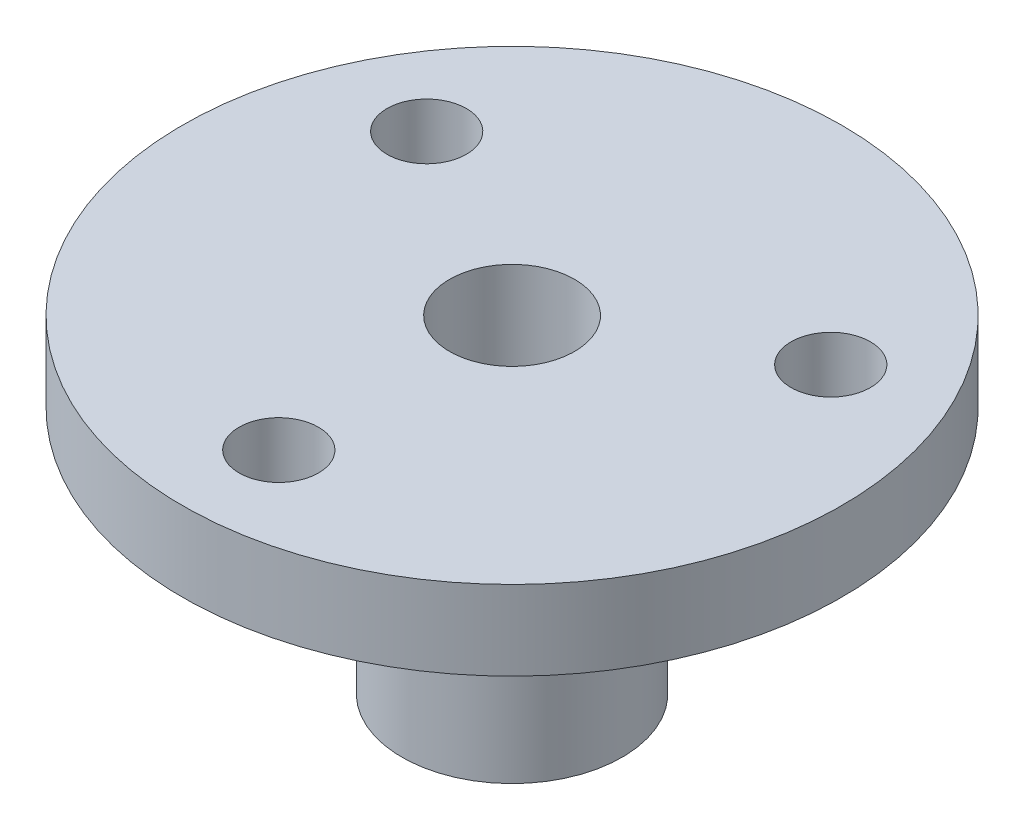
ISO-10303-21;
HEADER;
FILE_DESCRIPTION(('STEP AP214'),'2;1');
FILE_NAME('part.step','',(''),(''),'','','');
FILE_SCHEMA(('AUTOMOTIVE_DESIGN { 1 0 10303 214 1 1 1 1 }'));
ENDSEC;
DATA;
#1=APPLICATION_CONTEXT('core data for automotive mechanical design processes');
#2=APPLICATION_PROTOCOL_DEFINITION('international standard','automotive_design',2000,#1);
#3=PRODUCT_CONTEXT('',#1,'mechanical');
#4=PRODUCT('Part','Part','',(#3));
#5=PRODUCT_RELATED_PRODUCT_CATEGORY('part','',(#4));
#6=PRODUCT_DEFINITION_FORMATION('','',#4);
#7=PRODUCT_DEFINITION_CONTEXT('part definition',#1,'design');
#8=PRODUCT_DEFINITION('design','',#6,#7);
#9=PRODUCT_DEFINITION_SHAPE('','',#8);
#10=(LENGTH_UNIT() NAMED_UNIT(*) SI_UNIT(.MILLI.,.METRE.));
#11=(NAMED_UNIT(*) PLANE_ANGLE_UNIT() SI_UNIT($,.RADIAN.));
#12=(NAMED_UNIT(*) SI_UNIT($,.STERADIAN.) SOLID_ANGLE_UNIT());
#13=UNCERTAINTY_MEASURE_WITH_UNIT(LENGTH_MEASURE(1.E-05),#10,'distance_accuracy_value','');
#14=(GEOMETRIC_REPRESENTATION_CONTEXT(3) GLOBAL_UNCERTAINTY_ASSIGNED_CONTEXT((#13)) GLOBAL_UNIT_ASSIGNED_CONTEXT((#10,
#11,#12)) REPRESENTATION_CONTEXT('',''));
#15=CARTESIAN_POINT('',(0.,0.,0.));
#16=DIRECTION('',(0.,0.,1.));
#17=DIRECTION('',(1.,0.,0.));
#18=AXIS2_PLACEMENT_3D('',#15,#16,#17);
#19=CARTESIAN_POINT('',(0.,0.,0.));
#20=DIRECTION('',(0.,-1.,0.));
#21=DIRECTION('',(0.,0.,-1.));
#22=AXIS2_PLACEMENT_3D('',#19,#20,#21);
#23=CYLINDRICAL_SURFACE('',#22,16.6);
#24=CARTESIAN_POINT('',(0.,16.5,0.));
#25=DIRECTION('',(0.,-1.,0.));
#26=DIRECTION('',(0.,0.,-1.));
#27=AXIS2_PLACEMENT_3D('',#24,#25,#26);
#28=CIRCLE('',#27,16.6);
#29=CARTESIAN_POINT('',(0.,16.5,-16.6));
#30=VERTEX_POINT('',#29);
#31=EDGE_CURVE('E10',#30,#30,#28,.T.);
#32=ORIENTED_EDGE('',*,*,#31,.T.);
#33=EDGE_LOOP('',(#32));
#34=FACE_BOUND('',#33,.T.);
#35=CARTESIAN_POINT('',(0.,12.5,0.));
#36=DIRECTION('',(0.,-1.,0.));
#37=DIRECTION('',(0.,0.,-1.));
#38=AXIS2_PLACEMENT_3D('',#35,#36,#37);
#39=CIRCLE('',#38,16.6);
#40=CARTESIAN_POINT('',(0.,12.5,-16.6));
#41=VERTEX_POINT('',#40);
#42=EDGE_CURVE('E56',#41,#41,#39,.T.);
#43=ORIENTED_EDGE('',*,*,#42,.F.);
#44=EDGE_LOOP('',(#43));
#45=FACE_BOUND('',#44,.T.);
#46=ADVANCED_FACE('F31',(#34,#45),#23,.T.);
#47=CARTESIAN_POINT('',(16.6,16.5,0.));
#48=DIRECTION('',(0.,1.,0.));
#49=DIRECTION('',(0.,0.,1.));
#50=AXIS2_PLACEMENT_3D('',#47,#48,#49);
#51=PLANE('',#50);
#52=CARTESIAN_POINT('',(-10.1757984944667,16.5,-5.87500000000029));
#53=DIRECTION('',(0.,-1.,0.));
#54=DIRECTION('',(0.,0.,-1.));
#55=AXIS2_PLACEMENT_3D('',#52,#53,#54);
#56=CIRCLE('',#55,2.00000000000067);
#57=CARTESIAN_POINT('',(-10.1757984944667,16.5,-7.87500000000096));
#58=VERTEX_POINT('',#57);
#59=EDGE_CURVE('E69',#58,#58,#56,.T.);
#60=ORIENTED_EDGE('',*,*,#59,.T.);
#61=EDGE_LOOP('',(#60));
#62=FACE_BOUND('',#61,.T.);
#63=CARTESIAN_POINT('',(10.1757984944677,16.5,-5.87499999999971));
#64=DIRECTION('',(0.,-1.,0.));
#65=DIRECTION('',(0.,0.,-1.));
#66=AXIS2_PLACEMENT_3D('',#63,#64,#65);
#67=CIRCLE('',#66,2.00000000000045);
#68=CARTESIAN_POINT('',(10.1757984944677,16.5,-7.87500000000016));
#69=VERTEX_POINT('',#68);
#70=EDGE_CURVE('E63',#69,#69,#67,.T.);
#71=ORIENTED_EDGE('',*,*,#70,.T.);
#72=EDGE_LOOP('',(#71));
#73=FACE_BOUND('',#72,.T.);
#74=CARTESIAN_POINT('',(0.,16.5,11.75));
#75=DIRECTION('',(0.,-1.,0.));
#76=DIRECTION('',(0.,0.,-1.));
#77=AXIS2_PLACEMENT_3D('',#74,#75,#76);
#78=CIRCLE('',#77,2.);
#79=CARTESIAN_POINT('',(0.,16.5,9.75));
#80=VERTEX_POINT('',#79);
#81=EDGE_CURVE('E59',#80,#80,#78,.T.);
#82=ORIENTED_EDGE('',*,*,#81,.T.);
#83=EDGE_LOOP('',(#82));
#84=FACE_BOUND('',#83,.T.);
#85=CARTESIAN_POINT('',(0.,16.5,0.));
#86=DIRECTION('',(0.,-1.,0.));
#87=DIRECTION('',(0.,0.,-1.));
#88=AXIS2_PLACEMENT_3D('',#85,#86,#87);
#89=CIRCLE('',#88,3.15);
#90=CARTESIAN_POINT('',(0.,16.5,-3.15));
#91=VERTEX_POINT('',#90);
#92=EDGE_CURVE('E37',#91,#91,#89,.T.);
#93=ORIENTED_EDGE('',*,*,#92,.T.);
#94=EDGE_LOOP('',(#93));
#95=FACE_BOUND('',#94,.T.);
#96=ORIENTED_EDGE('',*,*,#31,.F.);
#97=EDGE_LOOP('',(#96));
#98=FACE_BOUND('',#97,.T.);
#99=ADVANCED_FACE('F78',(#62,#73,#84,#95,#98),#51,.T.);
#100=CARTESIAN_POINT('',(0.,0.,0.));
#101=DIRECTION('',(0.,-1.,0.));
#102=DIRECTION('',(0.,0.,-1.));
#103=AXIS2_PLACEMENT_3D('',#100,#101,#102);
#104=CYLINDRICAL_SURFACE('',#103,3.15);
#105=CARTESIAN_POINT('',(0.,0.,0.));
#106=DIRECTION('',(0.,-1.,0.));
#107=DIRECTION('',(0.,0.,-1.));
#108=AXIS2_PLACEMENT_3D('',#105,#106,#107);
#109=CIRCLE('',#108,3.15);
#110=CARTESIAN_POINT('',(0.,0.,-3.15));
#111=VERTEX_POINT('',#110);
#112=EDGE_CURVE('E41',#111,#111,#109,.T.);
#113=ORIENTED_EDGE('',*,*,#112,.T.);
#114=EDGE_LOOP('',(#113));
#115=FACE_BOUND('',#114,.T.);
#116=ORIENTED_EDGE('',*,*,#92,.F.);
#117=EDGE_LOOP('',(#116));
#118=FACE_BOUND('',#117,.T.);
#119=ADVANCED_FACE('F116',(#115,#118),#104,.F.);
#120=CARTESIAN_POINT('',(3.15,0.,0.));
#121=DIRECTION('',(0.,-1.,0.));
#122=DIRECTION('',(0.,0.,-1.));
#123=AXIS2_PLACEMENT_3D('',#120,#121,#122);
#124=PLANE('',#123);
#125=CARTESIAN_POINT('',(0.,0.,0.));
#126=DIRECTION('',(0.,-1.,0.));
#127=DIRECTION('',(0.,0.,-1.));
#128=AXIS2_PLACEMENT_3D('',#125,#126,#127);
#129=CIRCLE('',#128,5.55);
#130=CARTESIAN_POINT('',(0.,0.,-5.55));
#131=VERTEX_POINT('',#130);
#132=EDGE_CURVE('E45',#131,#131,#129,.T.);
#133=ORIENTED_EDGE('',*,*,#132,.T.);
#134=EDGE_LOOP('',(#133));
#135=FACE_BOUND('',#134,.T.);
#136=ORIENTED_EDGE('',*,*,#112,.F.);
#137=EDGE_LOOP('',(#136));
#138=FACE_BOUND('',#137,.T.);
#139=ADVANCED_FACE('F110',(#135,#138),#124,.T.);
#140=CARTESIAN_POINT('',(0.,0.,0.));
#141=DIRECTION('',(0.,-1.,0.));
#142=DIRECTION('',(0.,0.,-1.));
#143=AXIS2_PLACEMENT_3D('',#140,#141,#142);
#144=CYLINDRICAL_SURFACE('',#143,5.55);
#145=CARTESIAN_POINT('',(0.,9.99999999999999,0.));
#146=DIRECTION('',(0.,-1.,0.));
#147=DIRECTION('',(0.,0.,-1.));
#148=AXIS2_PLACEMENT_3D('',#145,#146,#147);
#149=CIRCLE('',#148,5.55);
#150=CARTESIAN_POINT('',(0.,9.99999999999999,-5.55));
#151=VERTEX_POINT('',#150);
#152=EDGE_CURVE('E50',#151,#151,#149,.T.);
#153=ORIENTED_EDGE('',*,*,#152,.T.);
#154=EDGE_LOOP('',(#153));
#155=FACE_BOUND('',#154,.T.);
#156=ORIENTED_EDGE('',*,*,#132,.F.);
#157=EDGE_LOOP('',(#156));
#158=FACE_BOUND('',#157,.T.);
#159=ADVANCED_FACE('F104',(#155,#158),#144,.T.);
#160=CARTESIAN_POINT('',(0.,10.,0.));
#161=DIRECTION('',(0.,-1.,0.));
#162=DIRECTION('',(0.,0.,-1.));
#163=AXIS2_PLACEMENT_3D('',#160,#161,#162);
#164=TOROIDAL_SURFACE('',#163,8.05,2.5);
#165=CARTESIAN_POINT('',(0.,12.5,0.));
#166=DIRECTION('',(0.,-1.,0.));
#167=DIRECTION('',(0.,0.,-1.));
#168=AXIS2_PLACEMENT_3D('',#165,#166,#167);
#169=CIRCLE('',#168,8.05000000000002);
#170=CARTESIAN_POINT('',(0.,12.5,-8.05000000000002));
#171=VERTEX_POINT('',#170);
#172=EDGE_CURVE('E53',#171,#171,#169,.T.);
#173=ORIENTED_EDGE('',*,*,#172,.T.);
#174=EDGE_LOOP('',(#173));
#175=FACE_BOUND('',#174,.T.);
#176=ORIENTED_EDGE('',*,*,#152,.F.);
#177=EDGE_LOOP('',(#176));
#178=FACE_BOUND('',#177,.T.);
#179=ADVANCED_FACE('F92',(#175,#178),#164,.F.);
#180=CARTESIAN_POINT('',(8.05000000000002,12.5,0.));
#181=DIRECTION('',(0.,-1.,0.));
#182=DIRECTION('',(0.,0.,-1.));
#183=AXIS2_PLACEMENT_3D('',#180,#181,#182);
#184=PLANE('',#183);
#185=CARTESIAN_POINT('',(-10.1757984944667,12.5,-5.87500000000029));
#186=DIRECTION('',(0.,-1.,0.));
#187=DIRECTION('',(0.,0.,-1.));
#188=AXIS2_PLACEMENT_3D('',#185,#186,#187);
#189=CIRCLE('',#188,2.00000000000067);
#190=CARTESIAN_POINT('',(-10.1757984944667,12.5,-7.87500000000096));
#191=VERTEX_POINT('',#190);
#192=EDGE_CURVE('E72',#191,#191,#189,.T.);
#193=ORIENTED_EDGE('',*,*,#192,.F.);
#194=EDGE_LOOP('',(#193));
#195=FACE_BOUND('',#194,.T.);
#196=CARTESIAN_POINT('',(10.1757984944677,12.5,-5.87499999999971));
#197=DIRECTION('',(0.,-1.,0.));
#198=DIRECTION('',(0.,0.,-1.));
#199=AXIS2_PLACEMENT_3D('',#196,#197,#198);
#200=CIRCLE('',#199,2.00000000000045);
#201=CARTESIAN_POINT('',(10.1757984944677,12.5,-7.87500000000016));
#202=VERTEX_POINT('',#201);
#203=EDGE_CURVE('E66',#202,#202,#200,.T.);
#204=ORIENTED_EDGE('',*,*,#203,.F.);
#205=EDGE_LOOP('',(#204));
#206=FACE_BOUND('',#205,.T.);
#207=CARTESIAN_POINT('',(0.,12.5,11.75));
#208=DIRECTION('',(0.,-1.,0.));
#209=DIRECTION('',(0.,0.,-1.));
#210=AXIS2_PLACEMENT_3D('',#207,#208,#209);
#211=CIRCLE('',#210,2.);
#212=CARTESIAN_POINT('',(0.,12.5,9.75));
#213=VERTEX_POINT('',#212);
#214=EDGE_CURVE('E60',#213,#213,#211,.T.);
#215=ORIENTED_EDGE('',*,*,#214,.F.);
#216=EDGE_LOOP('',(#215));
#217=FACE_BOUND('',#216,.T.);
#218=ORIENTED_EDGE('',*,*,#42,.T.);
#219=EDGE_LOOP('',(#218));
#220=FACE_BOUND('',#219,.T.);
#221=ORIENTED_EDGE('',*,*,#172,.F.);
#222=EDGE_LOOP('',(#221));
#223=FACE_BOUND('',#222,.T.);
#224=ADVANCED_FACE('F88',(#195,#206,#217,#220,#223),#184,.T.);
#225=CARTESIAN_POINT('',(0.,16.5,11.75));
#226=DIRECTION('',(0.,-1.,0.));
#227=DIRECTION('',(0.,0.,-1.));
#228=AXIS2_PLACEMENT_3D('',#225,#226,#227);
#229=CYLINDRICAL_SURFACE('',#228,2.);
#230=ORIENTED_EDGE('',*,*,#81,.F.);
#231=EDGE_LOOP('',(#230));
#232=FACE_BOUND('',#231,.T.);
#233=ORIENTED_EDGE('',*,*,#214,.T.);
#234=EDGE_LOOP('',(#233));
#235=FACE_BOUND('',#234,.T.);
#236=ADVANCED_FACE('F91',(#232,#235),#229,.F.);
#237=CARTESIAN_POINT('',(10.1757984944677,16.5,-5.87499999999971));
#238=DIRECTION('',(0.,-1.,0.));
#239=DIRECTION('',(0.,0.,-1.));
#240=AXIS2_PLACEMENT_3D('',#237,#238,#239);
#241=CYLINDRICAL_SURFACE('',#240,2.00000000000045);
#242=ORIENTED_EDGE('',*,*,#70,.F.);
#243=EDGE_LOOP('',(#242));
#244=FACE_BOUND('',#243,.T.);
#245=ORIENTED_EDGE('',*,*,#203,.T.);
#246=EDGE_LOOP('',(#245));
#247=FACE_BOUND('',#246,.T.);
#248=ADVANCED_FACE('F84',(#244,#247),#241,.F.);
#249=CARTESIAN_POINT('',(-10.1757984944667,16.5,-5.87500000000029));
#250=DIRECTION('',(0.,-1.,0.));
#251=DIRECTION('',(0.,0.,-1.));
#252=AXIS2_PLACEMENT_3D('',#249,#250,#251);
#253=CYLINDRICAL_SURFACE('',#252,2.00000000000067);
#254=ORIENTED_EDGE('',*,*,#59,.F.);
#255=EDGE_LOOP('',(#254));
#256=FACE_BOUND('',#255,.T.);
#257=ORIENTED_EDGE('',*,*,#192,.T.);
#258=EDGE_LOOP('',(#257));
#259=FACE_BOUND('',#258,.T.);
#260=ADVANCED_FACE('F81',(#256,#259),#253,.F.);
#261=CLOSED_SHELL('',(#46,#99,#119,#139,#159,#179,#224,#236,#248,#260));
#262=MANIFOLD_SOLID_BREP('B2',#261);
#263=ADVANCED_BREP_SHAPE_REPRESENTATION('',(#18,#262),#14);
#264=SHAPE_DEFINITION_REPRESENTATION(#9,#263);
ENDSEC;
END-ISO-10303-21;
